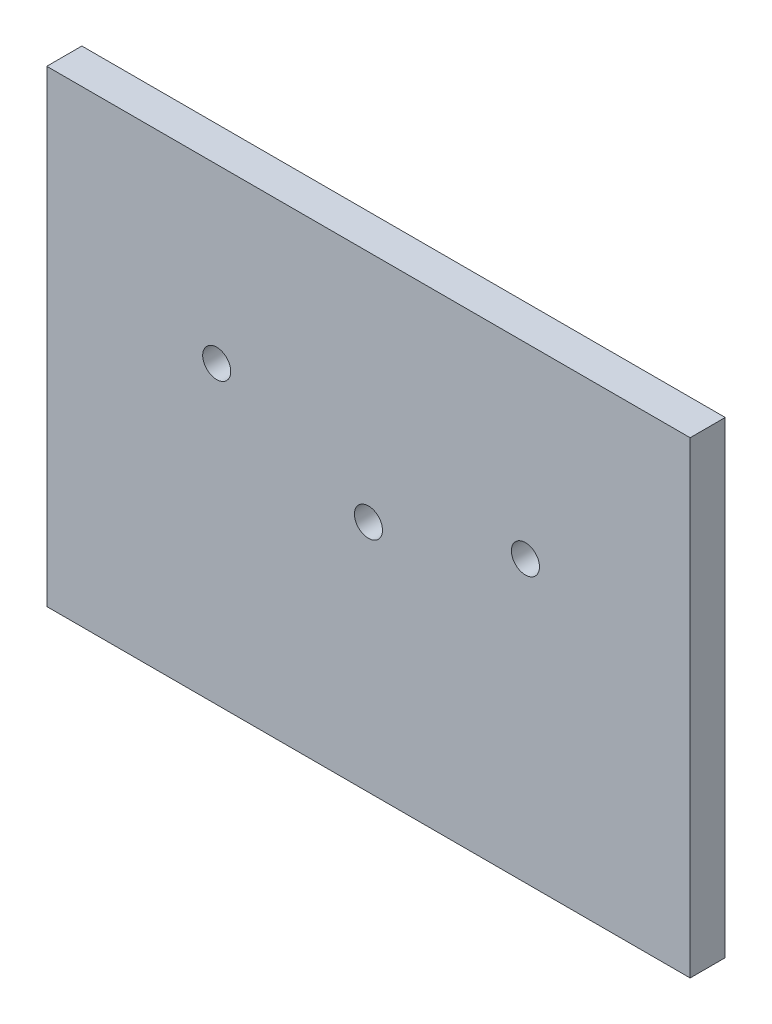
ISO-10303-21;
HEADER;
FILE_DESCRIPTION(('STEP AP214'),'2;1');
FILE_NAME('part.step','',(''),(''),'','','');
FILE_SCHEMA(('AUTOMOTIVE_DESIGN { 1 0 10303 214 1 1 1 1 }'));
ENDSEC;
DATA;
#1=APPLICATION_CONTEXT('core data for automotive mechanical design processes');
#2=APPLICATION_PROTOCOL_DEFINITION('international standard','automotive_design',2000,#1);
#3=PRODUCT_CONTEXT('',#1,'mechanical');
#4=PRODUCT('Part','Part','',(#3));
#5=PRODUCT_RELATED_PRODUCT_CATEGORY('part','',(#4));
#6=PRODUCT_DEFINITION_FORMATION('','',#4);
#7=PRODUCT_DEFINITION_CONTEXT('part definition',#1,'design');
#8=PRODUCT_DEFINITION('design','',#6,#7);
#9=PRODUCT_DEFINITION_SHAPE('','',#8);
#10=(LENGTH_UNIT() NAMED_UNIT(*) SI_UNIT(.MILLI.,.METRE.));
#11=(NAMED_UNIT(*) PLANE_ANGLE_UNIT() SI_UNIT($,.RADIAN.));
#12=(NAMED_UNIT(*) SI_UNIT($,.STERADIAN.) SOLID_ANGLE_UNIT());
#13=UNCERTAINTY_MEASURE_WITH_UNIT(LENGTH_MEASURE(1.E-05),#10,'distance_accuracy_value','');
#14=(GEOMETRIC_REPRESENTATION_CONTEXT(3) GLOBAL_UNCERTAINTY_ASSIGNED_CONTEXT((#13)) GLOBAL_UNIT_ASSIGNED_CONTEXT((#10,
#11,#12)) REPRESENTATION_CONTEXT('',''));
#15=CARTESIAN_POINT('',(0.,0.,0.));
#16=DIRECTION('',(0.,0.,1.));
#17=DIRECTION('',(1.,0.,0.));
#18=AXIS2_PLACEMENT_3D('',#15,#16,#17);
#19=CARTESIAN_POINT('',(0.,0.,30.));
#20=DIRECTION('',(0.,0.,-1.));
#21=DIRECTION('',(-1.,0.,0.));
#22=AXIS2_PLACEMENT_3D('',#19,#20,#21);
#23=PLANE('',#22);
#24=DIRECTION('',(0.,1.,0.));
#25=VECTOR('',#24,1.);
#26=CARTESIAN_POINT('',(275.,-200.,30.));
#27=LINE('',#26,#25);
#28=CARTESIAN_POINT('',(275.,-200.,30.));
#29=VERTEX_POINT('',#28);
#30=CARTESIAN_POINT('',(275.,200.,30.));
#31=VERTEX_POINT('',#30);
#32=EDGE_CURVE('E85',#29,#31,#27,.T.);
#33=ORIENTED_EDGE('',*,*,#32,.T.);
#34=DIRECTION('',(-1.,0.,0.));
#35=VECTOR('',#34,1.);
#36=CARTESIAN_POINT('',(-275.,200.,30.));
#37=LINE('',#36,#35);
#38=CARTESIAN_POINT('',(-275.,200.,30.));
#39=VERTEX_POINT('',#38);
#40=EDGE_CURVE('E80',#31,#39,#37,.T.);
#41=ORIENTED_EDGE('',*,*,#40,.T.);
#42=DIRECTION('',(0.,-1.,0.));
#43=VECTOR('',#42,1.);
#44=CARTESIAN_POINT('',(-275.,-200.,30.));
#45=LINE('',#44,#43);
#46=CARTESIAN_POINT('',(-275.,-200.,30.));
#47=VERTEX_POINT('',#46);
#48=EDGE_CURVE('E83',#39,#47,#45,.T.);
#49=ORIENTED_EDGE('',*,*,#48,.T.);
#50=DIRECTION('',(1.,0.,0.));
#51=VECTOR('',#50,1.);
#52=CARTESIAN_POINT('',(-275.,-200.,30.));
#53=LINE('',#52,#51);
#54=EDGE_CURVE('E50',#47,#29,#53,.T.);
#55=ORIENTED_EDGE('',*,*,#54,.T.);
#56=EDGE_LOOP('',(#33,#41,#49,#55));
#57=FACE_BOUND('',#56,.T.);
#58=CARTESIAN_POINT('',(-129.722465626057,52.650564212519,30.));
#59=DIRECTION('',(0.,0.,1.));
#60=DIRECTION('',(1.,0.,0.));
#61=AXIS2_PLACEMENT_3D('',#58,#59,#60);
#62=CIRCLE('',#61,12.);
#63=CARTESIAN_POINT('',(-117.722465626057,52.650564212519,30.));
#64=VERTEX_POINT('',#63);
#65=EDGE_CURVE('E100',#64,#64,#62,.T.);
#66=ORIENTED_EDGE('',*,*,#65,.F.);
#67=EDGE_LOOP('',(#66));
#68=FACE_BOUND('',#67,.T.);
#69=CARTESIAN_POINT('',(0.,0.,30.));
#70=DIRECTION('',(0.,0.,1.));
#71=DIRECTION('',(1.,0.,0.));
#72=AXIS2_PLACEMENT_3D('',#69,#70,#71);
#73=CIRCLE('',#72,12.);
#74=CARTESIAN_POINT('',(12.,0.,30.));
#75=VERTEX_POINT('',#74);
#76=EDGE_CURVE('E115',#75,#75,#73,.T.);
#77=ORIENTED_EDGE('',*,*,#76,.F.);
#78=EDGE_LOOP('',(#77));
#79=FACE_BOUND('',#78,.T.);
#80=CARTESIAN_POINT('',(134.181820579904,39.9404434860519,30.));
#81=DIRECTION('',(0.,0.,1.));
#82=DIRECTION('',(1.,0.,0.));
#83=AXIS2_PLACEMENT_3D('',#80,#81,#82);
#84=CIRCLE('',#83,11.9999999999999);
#85=CARTESIAN_POINT('',(146.181820579904,39.9404434860519,30.));
#86=VERTEX_POINT('',#85);
#87=EDGE_CURVE('E121',#86,#86,#84,.T.);
#88=ORIENTED_EDGE('',*,*,#87,.F.);
#89=EDGE_LOOP('',(#88));
#90=FACE_BOUND('',#89,.T.);
#91=ADVANCED_FACE('F33',(#57,#68,#79,#90),#23,.F.);
#92=CARTESIAN_POINT('',(0.,0.,0.));
#93=DIRECTION('',(0.,0.,-1.));
#94=DIRECTION('',(-1.,0.,0.));
#95=AXIS2_PLACEMENT_3D('',#92,#93,#94);
#96=PLANE('',#95);
#97=CARTESIAN_POINT('',(0.,0.,0.));
#98=DIRECTION('',(0.,0.,1.));
#99=DIRECTION('',(1.,0.,0.));
#100=AXIS2_PLACEMENT_3D('',#97,#98,#99);
#101=CIRCLE('',#100,12.);
#102=CARTESIAN_POINT('',(12.,0.,0.));
#103=VERTEX_POINT('',#102);
#104=EDGE_CURVE('E118',#103,#103,#101,.T.);
#105=ORIENTED_EDGE('',*,*,#104,.T.);
#106=EDGE_LOOP('',(#105));
#107=FACE_BOUND('',#106,.T.);
#108=DIRECTION('',(0.,1.,0.));
#109=VECTOR('',#108,1.);
#110=CARTESIAN_POINT('',(275.,-200.,0.));
#111=LINE('',#110,#109);
#112=CARTESIAN_POINT('',(275.,-200.,0.));
#113=VERTEX_POINT('',#112);
#114=CARTESIAN_POINT('',(275.,200.,0.));
#115=VERTEX_POINT('',#114);
#116=EDGE_CURVE('E97',#113,#115,#111,.T.);
#117=ORIENTED_EDGE('',*,*,#116,.F.);
#118=DIRECTION('',(1.,0.,0.));
#119=VECTOR('',#118,1.);
#120=CARTESIAN_POINT('',(-275.,-200.,0.));
#121=LINE('',#120,#119);
#122=CARTESIAN_POINT('',(-275.,-200.,0.));
#123=VERTEX_POINT('',#122);
#124=EDGE_CURVE('E73',#123,#113,#121,.T.);
#125=ORIENTED_EDGE('',*,*,#124,.F.);
#126=DIRECTION('',(0.,-1.,0.));
#127=VECTOR('',#126,1.);
#128=CARTESIAN_POINT('',(-275.,-200.,0.));
#129=LINE('',#128,#127);
#130=CARTESIAN_POINT('',(-275.,200.,0.));
#131=VERTEX_POINT('',#130);
#132=EDGE_CURVE('E67',#131,#123,#129,.T.);
#133=ORIENTED_EDGE('',*,*,#132,.F.);
#134=DIRECTION('',(-1.,0.,0.));
#135=VECTOR('',#134,1.);
#136=CARTESIAN_POINT('',(-275.,200.,0.));
#137=LINE('',#136,#135);
#138=EDGE_CURVE('E89',#115,#131,#137,.T.);
#139=ORIENTED_EDGE('',*,*,#138,.F.);
#140=EDGE_LOOP('',(#117,#125,#133,#139));
#141=FACE_BOUND('',#140,.T.);
#142=CARTESIAN_POINT('',(-129.722465626057,52.650564212519,0.));
#143=DIRECTION('',(0.,0.,1.));
#144=DIRECTION('',(1.,0.,0.));
#145=AXIS2_PLACEMENT_3D('',#142,#143,#144);
#146=CIRCLE('',#145,12.);
#147=CARTESIAN_POINT('',(-117.722465626057,52.650564212519,0.));
#148=VERTEX_POINT('',#147);
#149=EDGE_CURVE('E112',#148,#148,#146,.T.);
#150=ORIENTED_EDGE('',*,*,#149,.T.);
#151=EDGE_LOOP('',(#150));
#152=FACE_BOUND('',#151,.T.);
#153=CARTESIAN_POINT('',(134.181820579904,39.9404434860519,0.));
#154=DIRECTION('',(0.,0.,1.));
#155=DIRECTION('',(1.,0.,0.));
#156=AXIS2_PLACEMENT_3D('',#153,#154,#155);
#157=CIRCLE('',#156,11.9999999999999);
#158=CARTESIAN_POINT('',(146.181820579904,39.9404434860519,0.));
#159=VERTEX_POINT('',#158);
#160=EDGE_CURVE('E124',#159,#159,#157,.T.);
#161=ORIENTED_EDGE('',*,*,#160,.T.);
#162=EDGE_LOOP('',(#161));
#163=FACE_BOUND('',#162,.T.);
#164=ADVANCED_FACE('F108',(#107,#141,#152,#163),#96,.T.);
#165=CARTESIAN_POINT('',(275.,-200.,30.));
#166=DIRECTION('',(-1.,0.,0.));
#167=DIRECTION('',(0.,0.,1.));
#168=AXIS2_PLACEMENT_3D('',#165,#166,#167);
#169=PLANE('',#168);
#170=ORIENTED_EDGE('',*,*,#116,.T.);
#171=DIRECTION('',(0.,0.,-1.));
#172=VECTOR('',#171,1.);
#173=CARTESIAN_POINT('',(275.,200.,30.));
#174=LINE('',#173,#172);
#175=EDGE_CURVE('E11',#31,#115,#174,.T.);
#176=ORIENTED_EDGE('',*,*,#175,.F.);
#177=ORIENTED_EDGE('',*,*,#32,.F.);
#178=DIRECTION('',(0.,0.,-1.));
#179=VECTOR('',#178,1.);
#180=CARTESIAN_POINT('',(275.,-200.,30.));
#181=LINE('',#180,#179);
#182=EDGE_CURVE('E93',#29,#113,#181,.T.);
#183=ORIENTED_EDGE('',*,*,#182,.T.);
#184=EDGE_LOOP('',(#170,#176,#177,#183));
#185=FACE_BOUND('',#184,.T.);
#186=ADVANCED_FACE('F35',(#185),#169,.F.);
#187=CARTESIAN_POINT('',(-275.,200.,30.));
#188=DIRECTION('',(0.,-1.,0.));
#189=DIRECTION('',(0.,0.,-1.));
#190=AXIS2_PLACEMENT_3D('',#187,#188,#189);
#191=PLANE('',#190);
#192=ORIENTED_EDGE('',*,*,#138,.T.);
#193=DIRECTION('',(0.,0.,-1.));
#194=VECTOR('',#193,1.);
#195=CARTESIAN_POINT('',(-275.,200.,30.));
#196=LINE('',#195,#194);
#197=EDGE_CURVE('E42',#39,#131,#196,.T.);
#198=ORIENTED_EDGE('',*,*,#197,.F.);
#199=ORIENTED_EDGE('',*,*,#40,.F.);
#200=ORIENTED_EDGE('',*,*,#175,.T.);
#201=EDGE_LOOP('',(#192,#198,#199,#200));
#202=FACE_BOUND('',#201,.T.);
#203=ADVANCED_FACE('F88',(#202),#191,.F.);
#204=CARTESIAN_POINT('',(-275.,-200.,30.));
#205=DIRECTION('',(1.,0.,0.));
#206=DIRECTION('',(0.,0.,-1.));
#207=AXIS2_PLACEMENT_3D('',#204,#205,#206);
#208=PLANE('',#207);
#209=ORIENTED_EDGE('',*,*,#132,.T.);
#210=DIRECTION('',(0.,0.,-1.));
#211=VECTOR('',#210,1.);
#212=CARTESIAN_POINT('',(-275.,-200.,30.));
#213=LINE('',#212,#211);
#214=EDGE_CURVE('E90',#47,#123,#213,.T.);
#215=ORIENTED_EDGE('',*,*,#214,.F.);
#216=ORIENTED_EDGE('',*,*,#48,.F.);
#217=ORIENTED_EDGE('',*,*,#197,.T.);
#218=EDGE_LOOP('',(#209,#215,#216,#217));
#219=FACE_BOUND('',#218,.T.);
#220=ADVANCED_FACE('F91',(#219),#208,.F.);
#221=CARTESIAN_POINT('',(-275.,-200.,30.));
#222=DIRECTION('',(0.,1.,0.));
#223=DIRECTION('',(0.,0.,1.));
#224=AXIS2_PLACEMENT_3D('',#221,#222,#223);
#225=PLANE('',#224);
#226=ORIENTED_EDGE('',*,*,#124,.T.);
#227=ORIENTED_EDGE('',*,*,#182,.F.);
#228=ORIENTED_EDGE('',*,*,#54,.F.);
#229=ORIENTED_EDGE('',*,*,#214,.T.);
#230=EDGE_LOOP('',(#226,#227,#228,#229));
#231=FACE_BOUND('',#230,.T.);
#232=ADVANCED_FACE('F105',(#231),#225,.F.);
#233=CARTESIAN_POINT('',(-129.722465626057,52.650564212519,30.));
#234=DIRECTION('',(0.,0.,-1.));
#235=DIRECTION('',(-1.,0.,0.));
#236=AXIS2_PLACEMENT_3D('',#233,#234,#235);
#237=CYLINDRICAL_SURFACE('',#236,12.);
#238=ORIENTED_EDGE('',*,*,#65,.T.);
#239=EDGE_LOOP('',(#238));
#240=FACE_BOUND('',#239,.T.);
#241=ORIENTED_EDGE('',*,*,#149,.F.);
#242=EDGE_LOOP('',(#241));
#243=FACE_BOUND('',#242,.T.);
#244=ADVANCED_FACE('F141',(#240,#243),#237,.F.);
#245=CARTESIAN_POINT('',(0.,0.,30.));
#246=DIRECTION('',(0.,0.,-1.));
#247=DIRECTION('',(-1.,0.,0.));
#248=AXIS2_PLACEMENT_3D('',#245,#246,#247);
#249=CYLINDRICAL_SURFACE('',#248,12.);
#250=ORIENTED_EDGE('',*,*,#76,.T.);
#251=EDGE_LOOP('',(#250));
#252=FACE_BOUND('',#251,.T.);
#253=ORIENTED_EDGE('',*,*,#104,.F.);
#254=EDGE_LOOP('',(#253));
#255=FACE_BOUND('',#254,.T.);
#256=ADVANCED_FACE('F187',(#252,#255),#249,.F.);
#257=CARTESIAN_POINT('',(134.181820579904,39.9404434860519,30.));
#258=DIRECTION('',(0.,0.,-1.));
#259=DIRECTION('',(-1.,0.,0.));
#260=AXIS2_PLACEMENT_3D('',#257,#258,#259);
#261=CYLINDRICAL_SURFACE('',#260,11.9999999999999);
#262=ORIENTED_EDGE('',*,*,#87,.T.);
#263=EDGE_LOOP('',(#262));
#264=FACE_BOUND('',#263,.T.);
#265=ORIENTED_EDGE('',*,*,#160,.F.);
#266=EDGE_LOOP('',(#265));
#267=FACE_BOUND('',#266,.T.);
#268=ADVANCED_FACE('F130',(#264,#267),#261,.F.);
#269=CLOSED_SHELL('',(#91,#164,#186,#203,#220,#232,#244,#256,#268));
#270=MANIFOLD_SOLID_BREP('B2',#269);
#271=ADVANCED_BREP_SHAPE_REPRESENTATION('',(#18,#270),#14);
#272=SHAPE_DEFINITION_REPRESENTATION(#9,#271);
ENDSEC;
END-ISO-10303-21;
